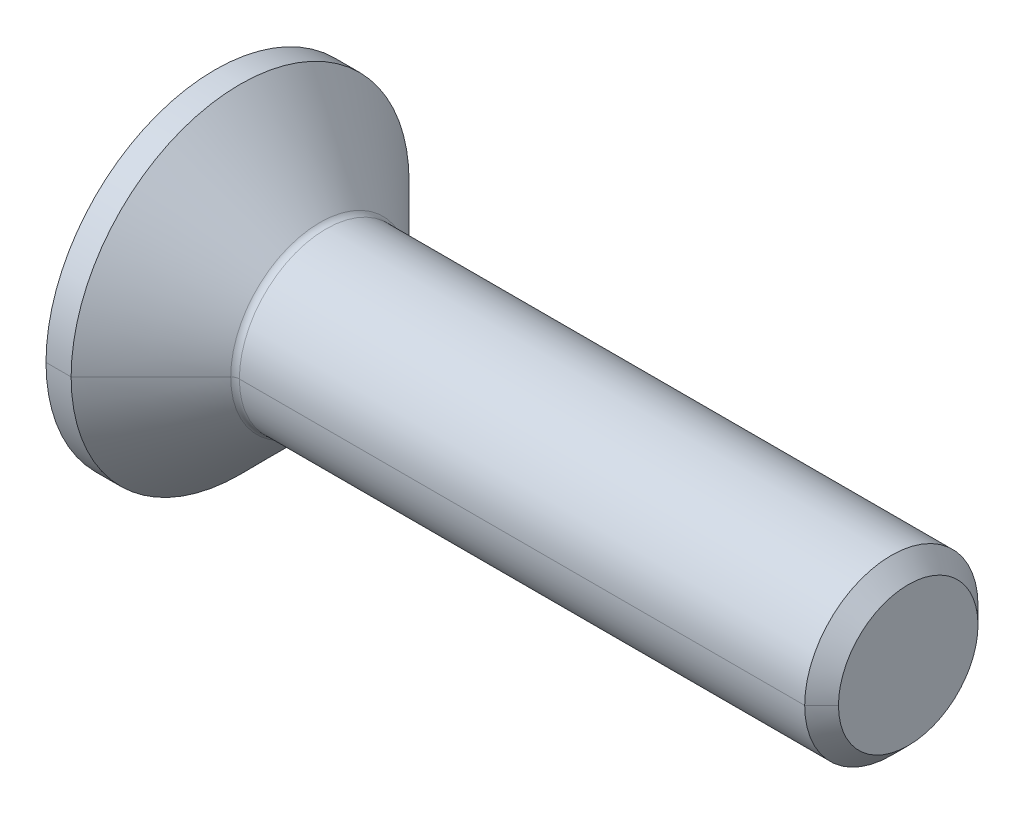
ISO-10303-21;
HEADER;
FILE_DESCRIPTION(('STEP AP214'),'2;1');
FILE_NAME('part.step','',(''),(''),'','','');
FILE_SCHEMA(('AUTOMOTIVE_DESIGN { 1 0 10303 214 1 1 1 1 }'));
ENDSEC;
DATA;
#1=APPLICATION_CONTEXT('core data for automotive mechanical design processes');
#2=APPLICATION_PROTOCOL_DEFINITION('international standard','automotive_design',2000,#1);
#3=PRODUCT_CONTEXT('',#1,'mechanical');
#4=PRODUCT('Part','Part','',(#3));
#5=PRODUCT_RELATED_PRODUCT_CATEGORY('part','',(#4));
#6=PRODUCT_DEFINITION_FORMATION('','',#4);
#7=PRODUCT_DEFINITION_CONTEXT('part definition',#1,'design');
#8=PRODUCT_DEFINITION('design','',#6,#7);
#9=PRODUCT_DEFINITION_SHAPE('','',#8);
#10=(LENGTH_UNIT() NAMED_UNIT(*) SI_UNIT(.MILLI.,.METRE.));
#11=(NAMED_UNIT(*) PLANE_ANGLE_UNIT() SI_UNIT($,.RADIAN.));
#12=(NAMED_UNIT(*) SI_UNIT($,.STERADIAN.) SOLID_ANGLE_UNIT());
#13=UNCERTAINTY_MEASURE_WITH_UNIT(LENGTH_MEASURE(1.E-05),#10,'distance_accuracy_value','');
#14=(GEOMETRIC_REPRESENTATION_CONTEXT(3) GLOBAL_UNCERTAINTY_ASSIGNED_CONTEXT((#13)) GLOBAL_UNIT_ASSIGNED_CONTEXT((#10,
#11,#12)) REPRESENTATION_CONTEXT('',''));
#15=CARTESIAN_POINT('',(0.,0.,0.));
#16=DIRECTION('',(0.,0.,1.));
#17=DIRECTION('',(1.,0.,0.));
#18=AXIS2_PLACEMENT_3D('',#15,#16,#17);
#19=CARTESIAN_POINT('',(1.5,0.,0.));
#20=DIRECTION('',(-1.,0.,0.));
#21=DIRECTION('',(0.,0.,1.));
#22=AXIS2_PLACEMENT_3D('',#19,#20,#21);
#23=CONICAL_SURFACE('',#22,1.25,1.0471975511966);
#24=DIRECTION('',(-0.5,0.,-0.866025403784436));
#25=VECTOR('',#24,1.);
#26=CARTESIAN_POINT('',(1.5,0.,-1.25));
#27=LINE('',#26,#25);
#28=CARTESIAN_POINT('',(2.22168783648704,0.,0.));
#29=VERTEX_POINT('',#28);
#30=CARTESIAN_POINT('',(1.5,0.,-1.25));
#31=VERTEX_POINT('',#30);
#32=EDGE_CURVE('E375',#29,#31,#27,.T.);
#33=ORIENTED_EDGE('',*,*,#32,.F.);
#34=DIRECTION('',(-0.5,0.,0.866025403784436));
#35=VECTOR('',#34,1.);
#36=CARTESIAN_POINT('',(1.5,0.,1.25));
#37=LINE('',#36,#35);
#38=CARTESIAN_POINT('',(1.5,0.,1.25));
#39=VERTEX_POINT('',#38);
#40=EDGE_CURVE('E379',#29,#39,#37,.T.);
#41=ORIENTED_EDGE('',*,*,#40,.T.);
#42=CARTESIAN_POINT('',(1.5,0.,0.));
#43=DIRECTION('',(-1.,0.,0.));
#44=DIRECTION('',(0.,0.,1.));
#45=AXIS2_PLACEMENT_3D('',#42,#43,#44);
#46=CIRCLE('',#45,1.25);
#47=CARTESIAN_POINT('',(1.5,1.08253175473055,0.625));
#48=VERTEX_POINT('',#47);
#49=EDGE_CURVE('E11',#39,#48,#46,.T.);
#50=ORIENTED_EDGE('',*,*,#49,.T.);
#51=CARTESIAN_POINT('',(1.5,0.,0.));
#52=DIRECTION('',(-1.,0.,0.));
#53=DIRECTION('',(0.,0.,1.));
#54=AXIS2_PLACEMENT_3D('',#51,#52,#53);
#55=CIRCLE('',#54,1.25);
#56=CARTESIAN_POINT('',(1.5,1.08253175473055,-0.625));
#57=VERTEX_POINT('',#56);
#58=EDGE_CURVE('E24',#48,#57,#55,.T.);
#59=ORIENTED_EDGE('',*,*,#58,.T.);
#60=CARTESIAN_POINT('',(1.5,0.,0.));
#61=DIRECTION('',(-1.,0.,0.));
#62=DIRECTION('',(0.,0.,1.));
#63=AXIS2_PLACEMENT_3D('',#60,#61,#62);
#64=CIRCLE('',#63,1.25);
#65=EDGE_CURVE('E307',#57,#31,#64,.T.);
#66=ORIENTED_EDGE('',*,*,#65,.T.);
#67=EDGE_LOOP('',(#33,#41,#50,#59,#66));
#68=FACE_BOUND('',#67,.T.);
#69=ADVANCED_FACE('F16',(#68),#23,.F.);
#70=CARTESIAN_POINT('',(1.5,-2.1650635094611,1.25));
#71=DIRECTION('',(-1.,0.,0.));
#72=DIRECTION('',(0.,0.,1.));
#73=AXIS2_PLACEMENT_3D('',#70,#71,#72);
#74=PLANE('',#73);
#75=ORIENTED_EDGE('',*,*,#49,.F.);
#76=DIRECTION('',(0.,-1.,0.));
#77=VECTOR('',#76,1.);
#78=CARTESIAN_POINT('',(1.5,0.721687836487033,1.25));
#79=LINE('',#78,#77);
#80=CARTESIAN_POINT('',(1.5,0.721687836487033,1.25));
#81=VERTEX_POINT('',#80);
#82=EDGE_CURVE('E48',#81,#39,#79,.T.);
#83=ORIENTED_EDGE('',*,*,#82,.F.);
#84=DIRECTION('',(0.,-0.5,0.866025403784439));
#85=VECTOR('',#84,1.);
#86=CARTESIAN_POINT('',(1.5,1.44337567297407,0.));
#87=LINE('',#86,#85);
#88=EDGE_CURVE('E334',#48,#81,#87,.T.);
#89=ORIENTED_EDGE('',*,*,#88,.F.);
#90=EDGE_LOOP('',(#75,#83,#89));
#91=FACE_BOUND('',#90,.T.);
#92=ADVANCED_FACE('F434',(#91),#74,.T.);
#93=CARTESIAN_POINT('',(1.5,-2.1650635094611,1.25));
#94=DIRECTION('',(-1.,0.,0.));
#95=DIRECTION('',(0.,0.,1.));
#96=AXIS2_PLACEMENT_3D('',#93,#94,#95);
#97=PLANE('',#96);
#98=ORIENTED_EDGE('',*,*,#58,.F.);
#99=DIRECTION('',(0.,-0.5,0.866025403784439));
#100=VECTOR('',#99,1.);
#101=CARTESIAN_POINT('',(1.5,1.44337567297407,0.));
#102=LINE('',#101,#100);
#103=CARTESIAN_POINT('',(1.5,1.44337567297407,0.));
#104=VERTEX_POINT('',#103);
#105=EDGE_CURVE('E330',#104,#48,#102,.T.);
#106=ORIENTED_EDGE('',*,*,#105,.F.);
#107=DIRECTION('',(0.,0.5,0.866025403784439));
#108=VECTOR('',#107,1.);
#109=CARTESIAN_POINT('',(1.5,0.721687836487033,-1.25));
#110=LINE('',#109,#108);
#111=EDGE_CURVE('E323',#57,#104,#110,.T.);
#112=ORIENTED_EDGE('',*,*,#111,.F.);
#113=EDGE_LOOP('',(#98,#106,#112));
#114=FACE_BOUND('',#113,.T.);
#115=ADVANCED_FACE('F357',(#114),#97,.T.);
#116=CARTESIAN_POINT('',(1.5,-2.1650635094611,1.25));
#117=DIRECTION('',(-1.,0.,0.));
#118=DIRECTION('',(0.,0.,1.));
#119=AXIS2_PLACEMENT_3D('',#116,#117,#118);
#120=PLANE('',#119);
#121=ORIENTED_EDGE('',*,*,#65,.F.);
#122=DIRECTION('',(0.,0.5,0.866025403784439));
#123=VECTOR('',#122,1.);
#124=CARTESIAN_POINT('',(1.5,0.721687836487033,-1.25));
#125=LINE('',#124,#123);
#126=CARTESIAN_POINT('',(1.5,0.721687836487033,-1.25));
#127=VERTEX_POINT('',#126);
#128=EDGE_CURVE('E285',#127,#57,#125,.T.);
#129=ORIENTED_EDGE('',*,*,#128,.F.);
#130=DIRECTION('',(0.,1.,0.));
#131=VECTOR('',#130,1.);
#132=CARTESIAN_POINT('',(1.5,-0.721687836487031,-1.25));
#133=LINE('',#132,#131);
#134=EDGE_CURVE('E286',#31,#127,#133,.T.);
#135=ORIENTED_EDGE('',*,*,#134,.F.);
#136=EDGE_LOOP('',(#121,#129,#135));
#137=FACE_BOUND('',#136,.T.);
#138=ADVANCED_FACE('F355',(#137),#120,.T.);
#139=CARTESIAN_POINT('',(1.5,-2.1650635094611,1.25));
#140=DIRECTION('',(-1.,0.,0.));
#141=DIRECTION('',(0.,0.,1.));
#142=AXIS2_PLACEMENT_3D('',#139,#140,#141);
#143=PLANE('',#142);
#144=CARTESIAN_POINT('',(1.5,0.,0.));
#145=DIRECTION('',(-1.,0.,0.));
#146=DIRECTION('',(0.,0.,1.));
#147=AXIS2_PLACEMENT_3D('',#144,#145,#146);
#148=CIRCLE('',#147,1.25);
#149=CARTESIAN_POINT('',(1.5,-1.08253175473055,-0.625));
#150=VERTEX_POINT('',#149);
#151=EDGE_CURVE('E369',#31,#150,#148,.T.);
#152=ORIENTED_EDGE('',*,*,#151,.F.);
#153=DIRECTION('',(0.,1.,0.));
#154=VECTOR('',#153,1.);
#155=CARTESIAN_POINT('',(1.5,-0.721687836487031,-1.25));
#156=LINE('',#155,#154);
#157=CARTESIAN_POINT('',(1.5,-0.721687836487031,-1.25));
#158=VERTEX_POINT('',#157);
#159=EDGE_CURVE('E313',#158,#31,#156,.T.);
#160=ORIENTED_EDGE('',*,*,#159,.F.);
#161=DIRECTION('',(0.,0.5,-0.866025403784439));
#162=VECTOR('',#161,1.);
#163=CARTESIAN_POINT('',(1.5,-1.44337567297406,0.));
#164=LINE('',#163,#162);
#165=EDGE_CURVE('E302',#150,#158,#164,.T.);
#166=ORIENTED_EDGE('',*,*,#165,.F.);
#167=EDGE_LOOP('',(#152,#160,#166));
#168=FACE_BOUND('',#167,.T.);
#169=ADVANCED_FACE('F371',(#168),#143,.T.);
#170=CARTESIAN_POINT('',(1.5,-2.1650635094611,1.25));
#171=DIRECTION('',(-1.,0.,0.));
#172=DIRECTION('',(0.,0.,1.));
#173=AXIS2_PLACEMENT_3D('',#170,#171,#172);
#174=PLANE('',#173);
#175=CARTESIAN_POINT('',(1.5,0.,0.));
#176=DIRECTION('',(-1.,0.,0.));
#177=DIRECTION('',(0.,0.,1.));
#178=AXIS2_PLACEMENT_3D('',#175,#176,#177);
#179=CIRCLE('',#178,1.25);
#180=CARTESIAN_POINT('',(1.5,-1.08253175473055,0.625));
#181=VERTEX_POINT('',#180);
#182=EDGE_CURVE('E213',#150,#181,#179,.T.);
#183=ORIENTED_EDGE('',*,*,#182,.F.);
#184=DIRECTION('',(0.,0.5,-0.866025403784439));
#185=VECTOR('',#184,1.);
#186=CARTESIAN_POINT('',(1.5,-1.44337567297406,0.));
#187=LINE('',#186,#185);
#188=CARTESIAN_POINT('',(1.5,-1.44337567297406,0.));
#189=VERTEX_POINT('',#188);
#190=EDGE_CURVE('E298',#189,#150,#187,.T.);
#191=ORIENTED_EDGE('',*,*,#190,.F.);
#192=DIRECTION('',(0.,-0.5,-0.866025403784439));
#193=VECTOR('',#192,1.);
#194=CARTESIAN_POINT('',(1.5,-0.721687836487031,1.25));
#195=LINE('',#194,#193);
#196=EDGE_CURVE('E310',#181,#189,#195,.T.);
#197=ORIENTED_EDGE('',*,*,#196,.F.);
#198=EDGE_LOOP('',(#183,#191,#197));
#199=FACE_BOUND('',#198,.T.);
#200=ADVANCED_FACE('F449',(#199),#174,.T.);
#201=CARTESIAN_POINT('',(1.5,-2.1650635094611,1.25));
#202=DIRECTION('',(-1.,0.,0.));
#203=DIRECTION('',(0.,0.,1.));
#204=AXIS2_PLACEMENT_3D('',#201,#202,#203);
#205=PLANE('',#204);
#206=CARTESIAN_POINT('',(1.5,0.,0.));
#207=DIRECTION('',(-1.,0.,0.));
#208=DIRECTION('',(0.,0.,1.));
#209=AXIS2_PLACEMENT_3D('',#206,#207,#208);
#210=CIRCLE('',#209,1.25);
#211=EDGE_CURVE('E206',#181,#39,#210,.T.);
#212=ORIENTED_EDGE('',*,*,#211,.F.);
#213=DIRECTION('',(0.,-0.5,-0.866025403784439));
#214=VECTOR('',#213,1.);
#215=CARTESIAN_POINT('',(1.5,-0.721687836487031,1.25));
#216=LINE('',#215,#214);
#217=CARTESIAN_POINT('',(1.5,-0.721687836487031,1.25));
#218=VERTEX_POINT('',#217);
#219=EDGE_CURVE('E37',#218,#181,#216,.T.);
#220=ORIENTED_EDGE('',*,*,#219,.F.);
#221=DIRECTION('',(0.,-1.,0.));
#222=VECTOR('',#221,1.);
#223=CARTESIAN_POINT('',(1.5,0.721687836487033,1.25));
#224=LINE('',#223,#222);
#225=EDGE_CURVE('E244',#39,#218,#224,.T.);
#226=ORIENTED_EDGE('',*,*,#225,.F.);
#227=EDGE_LOOP('',(#212,#220,#226));
#228=FACE_BOUND('',#227,.T.);
#229=ADVANCED_FACE('F452',(#228),#205,.T.);
#230=CARTESIAN_POINT('',(1.5,-0.721687836487031,1.25));
#231=DIRECTION('',(0.,0.866025403784439,-0.5));
#232=DIRECTION('',(-1.,0.,0.));
#233=AXIS2_PLACEMENT_3D('',#230,#231,#232);
#234=PLANE('',#233);
#235=DIRECTION('',(0.,-0.5,-0.866025403784439));
#236=VECTOR('',#235,1.);
#237=CARTESIAN_POINT('',(0.,-0.721687836487031,1.25));
#238=LINE('',#237,#236);
#239=CARTESIAN_POINT('',(0.,-0.721687836487031,1.25));
#240=VERTEX_POINT('',#239);
#241=CARTESIAN_POINT('',(0.,-1.44337567297406,0.));
#242=VERTEX_POINT('',#241);
#243=EDGE_CURVE('E230',#240,#242,#238,.T.);
#244=ORIENTED_EDGE('',*,*,#243,.F.);
#245=DIRECTION('',(-1.,0.,0.));
#246=VECTOR('',#245,1.);
#247=CARTESIAN_POINT('',(1.5,-0.721687836487031,1.25));
#248=LINE('',#247,#246);
#249=EDGE_CURVE('E241',#218,#240,#248,.T.);
#250=ORIENTED_EDGE('',*,*,#249,.F.);
#251=ORIENTED_EDGE('',*,*,#219,.T.);
#252=ORIENTED_EDGE('',*,*,#196,.T.);
#253=DIRECTION('',(-1.,0.,0.));
#254=VECTOR('',#253,1.);
#255=CARTESIAN_POINT('',(1.5,-1.44337567297406,0.));
#256=LINE('',#255,#254);
#257=EDGE_CURVE('E295',#189,#242,#256,.T.);
#258=ORIENTED_EDGE('',*,*,#257,.T.);
#259=EDGE_LOOP('',(#244,#250,#251,#252,#258));
#260=FACE_BOUND('',#259,.T.);
#261=ADVANCED_FACE('F456',(#260),#234,.T.);
#262=CARTESIAN_POINT('',(1.5,0.721687836487033,1.25));
#263=DIRECTION('',(0.,0.,-1.));
#264=DIRECTION('',(0.,-1.,0.));
#265=AXIS2_PLACEMENT_3D('',#262,#263,#264);
#266=PLANE('',#265);
#267=DIRECTION('',(0.,-1.,0.));
#268=VECTOR('',#267,1.);
#269=CARTESIAN_POINT('',(0.,0.721687836487033,1.25));
#270=LINE('',#269,#268);
#271=CARTESIAN_POINT('',(0.,0.721687836487033,1.25));
#272=VERTEX_POINT('',#271);
#273=EDGE_CURVE('E221',#272,#240,#270,.T.);
#274=ORIENTED_EDGE('',*,*,#273,.F.);
#275=DIRECTION('',(-1.,0.,0.));
#276=VECTOR('',#275,1.);
#277=CARTESIAN_POINT('',(1.5,0.721687836487033,1.25));
#278=LINE('',#277,#276);
#279=EDGE_CURVE('E338',#81,#272,#278,.T.);
#280=ORIENTED_EDGE('',*,*,#279,.F.);
#281=ORIENTED_EDGE('',*,*,#82,.T.);
#282=ORIENTED_EDGE('',*,*,#225,.T.);
#283=ORIENTED_EDGE('',*,*,#249,.T.);
#284=EDGE_LOOP('',(#274,#280,#281,#282,#283));
#285=FACE_BOUND('',#284,.T.);
#286=ADVANCED_FACE('F459',(#285),#266,.T.);
#287=CARTESIAN_POINT('',(1.5,1.44337567297407,0.));
#288=DIRECTION('',(0.,-0.866025403784439,-0.5));
#289=DIRECTION('',(0.,0.5,-0.866025403784439));
#290=AXIS2_PLACEMENT_3D('',#287,#288,#289);
#291=PLANE('',#290);
#292=DIRECTION('',(0.,-0.5,0.866025403784439));
#293=VECTOR('',#292,1.);
#294=CARTESIAN_POINT('',(0.,1.44337567297407,0.));
#295=LINE('',#294,#293);
#296=CARTESIAN_POINT('',(0.,1.44337567297407,0.));
#297=VERTEX_POINT('',#296);
#298=EDGE_CURVE('E217',#297,#272,#295,.T.);
#299=ORIENTED_EDGE('',*,*,#298,.F.);
#300=DIRECTION('',(-1.,0.,0.));
#301=VECTOR('',#300,1.);
#302=CARTESIAN_POINT('',(1.5,1.44337567297407,0.));
#303=LINE('',#302,#301);
#304=EDGE_CURVE('E327',#104,#297,#303,.T.);
#305=ORIENTED_EDGE('',*,*,#304,.F.);
#306=ORIENTED_EDGE('',*,*,#105,.T.);
#307=ORIENTED_EDGE('',*,*,#88,.T.);
#308=ORIENTED_EDGE('',*,*,#279,.T.);
#309=EDGE_LOOP('',(#299,#305,#306,#307,#308));
#310=FACE_BOUND('',#309,.T.);
#311=ADVANCED_FACE('F463',(#310),#291,.T.);
#312=CARTESIAN_POINT('',(1.5,0.721687836487033,-1.25));
#313=DIRECTION('',(0.,-0.866025403784439,0.5));
#314=DIRECTION('',(-1.,0.,0.));
#315=AXIS2_PLACEMENT_3D('',#312,#313,#314);
#316=PLANE('',#315);
#317=DIRECTION('',(0.,0.5,0.866025403784439));
#318=VECTOR('',#317,1.);
#319=CARTESIAN_POINT('',(0.,0.721687836487033,-1.25));
#320=LINE('',#319,#318);
#321=CARTESIAN_POINT('',(0.,0.721687836487033,-1.25));
#322=VERTEX_POINT('',#321);
#323=EDGE_CURVE('E222',#322,#297,#320,.T.);
#324=ORIENTED_EDGE('',*,*,#323,.F.);
#325=DIRECTION('',(-1.,0.,0.));
#326=VECTOR('',#325,1.);
#327=CARTESIAN_POINT('',(1.5,0.721687836487033,-1.25));
#328=LINE('',#327,#326);
#329=EDGE_CURVE('E282',#127,#322,#328,.T.);
#330=ORIENTED_EDGE('',*,*,#329,.F.);
#331=ORIENTED_EDGE('',*,*,#128,.T.);
#332=ORIENTED_EDGE('',*,*,#111,.T.);
#333=ORIENTED_EDGE('',*,*,#304,.T.);
#334=EDGE_LOOP('',(#324,#330,#331,#332,#333));
#335=FACE_BOUND('',#334,.T.);
#336=ADVANCED_FACE('F361',(#335),#316,.T.);
#337=CARTESIAN_POINT('',(1.5,-0.721687836487031,-1.25));
#338=DIRECTION('',(0.,0.,1.));
#339=DIRECTION('',(0.,-1.,0.));
#340=AXIS2_PLACEMENT_3D('',#337,#338,#339);
#341=PLANE('',#340);
#342=DIRECTION('',(0.,1.,0.));
#343=VECTOR('',#342,1.);
#344=CARTESIAN_POINT('',(0.,-0.721687836487031,-1.25));
#345=LINE('',#344,#343);
#346=CARTESIAN_POINT('',(0.,-0.721687836487031,-1.25));
#347=VERTEX_POINT('',#346);
#348=EDGE_CURVE('E272',#347,#322,#345,.T.);
#349=ORIENTED_EDGE('',*,*,#348,.F.);
#350=DIRECTION('',(-1.,0.,0.));
#351=VECTOR('',#350,1.);
#352=CARTESIAN_POINT('',(1.5,-0.721687836487031,-1.25));
#353=LINE('',#352,#351);
#354=EDGE_CURVE('E306',#158,#347,#353,.T.);
#355=ORIENTED_EDGE('',*,*,#354,.F.);
#356=ORIENTED_EDGE('',*,*,#159,.T.);
#357=ORIENTED_EDGE('',*,*,#134,.T.);
#358=ORIENTED_EDGE('',*,*,#329,.T.);
#359=EDGE_LOOP('',(#349,#355,#356,#357,#358));
#360=FACE_BOUND('',#359,.T.);
#361=ADVANCED_FACE('F364',(#360),#341,.T.);
#362=CARTESIAN_POINT('',(1.5,-1.44337567297406,0.));
#363=DIRECTION('',(0.,0.866025403784439,0.5));
#364=DIRECTION('',(1.,0.,0.));
#365=AXIS2_PLACEMENT_3D('',#362,#363,#364);
#366=PLANE('',#365);
#367=DIRECTION('',(0.,0.5,-0.866025403784439));
#368=VECTOR('',#367,1.);
#369=CARTESIAN_POINT('',(0.,-1.44337567297406,0.));
#370=LINE('',#369,#368);
#371=EDGE_CURVE('E268',#242,#347,#370,.T.);
#372=ORIENTED_EDGE('',*,*,#371,.F.);
#373=ORIENTED_EDGE('',*,*,#257,.F.);
#374=ORIENTED_EDGE('',*,*,#190,.T.);
#375=ORIENTED_EDGE('',*,*,#165,.T.);
#376=ORIENTED_EDGE('',*,*,#354,.T.);
#377=EDGE_LOOP('',(#372,#373,#374,#375,#376));
#378=FACE_BOUND('',#377,.T.);
#379=ADVANCED_FACE('F472',(#378),#366,.T.);
#380=CARTESIAN_POINT('',(2.56284271247466,0.,0.));
#381=DIRECTION('',(-1.,0.,0.));
#382=DIRECTION('',(0.,0.,1.));
#383=AXIS2_PLACEMENT_3D('',#380,#381,#382);
#384=TOROIDAL_SURFACE('',#383,2.19999999999995,0.2);
#385=CARTESIAN_POINT('',(2.56284271247466,0.,-2.19999999999995));
#386=DIRECTION('',(0.,1.,0.));
#387=DIRECTION('',(0.,0.,1.));
#388=AXIS2_PLACEMENT_3D('',#385,#386,#387);
#389=CIRCLE('',#388,0.2);
#390=CARTESIAN_POINT('',(2.42142135623735,0.,-2.05857864376265));
#391=VERTEX_POINT('',#390);
#392=CARTESIAN_POINT('',(2.56284271247466,0.,-1.99999999999995));
#393=VERTEX_POINT('',#392);
#394=EDGE_CURVE('E193',#391,#393,#389,.T.);
#395=ORIENTED_EDGE('',*,*,#394,.F.);
#396=CARTESIAN_POINT('',(2.42142135623735,0.,0.));
#397=DIRECTION('',(-1.,0.,0.));
#398=DIRECTION('',(0.,0.,1.));
#399=AXIS2_PLACEMENT_3D('',#396,#397,#398);
#400=CIRCLE('',#399,2.05857864376265);
#401=CARTESIAN_POINT('',(2.42142135623735,0.,2.05857864376265));
#402=VERTEX_POINT('',#401);
#403=EDGE_CURVE('E180',#402,#391,#400,.T.);
#404=ORIENTED_EDGE('',*,*,#403,.F.);
#405=CARTESIAN_POINT('',(2.56284271247466,0.,2.19999999999995));
#406=DIRECTION('',(0.,-1.,0.));
#407=DIRECTION('',(0.,0.,-1.));
#408=AXIS2_PLACEMENT_3D('',#405,#406,#407);
#409=CIRCLE('',#408,0.2);
#410=CARTESIAN_POINT('',(2.56284271247466,0.,1.99999999999995));
#411=VERTEX_POINT('',#410);
#412=EDGE_CURVE('E204',#402,#411,#409,.T.);
#413=ORIENTED_EDGE('',*,*,#412,.T.);
#414=CARTESIAN_POINT('',(2.56284271247466,0.,0.));
#415=DIRECTION('',(1.,0.,0.));
#416=DIRECTION('',(0.,0.,1.));
#417=AXIS2_PLACEMENT_3D('',#414,#415,#416);
#418=CIRCLE('',#417,1.99999999999995);
#419=EDGE_CURVE('E196',#393,#411,#418,.T.);
#420=ORIENTED_EDGE('',*,*,#419,.F.);
#421=EDGE_LOOP('',(#395,#404,#413,#420));
#422=FACE_BOUND('',#421,.T.);
#423=ADVANCED_FACE('F194',(#422),#384,.F.);
#424=CARTESIAN_POINT('',(16.,1.61,0.));
#425=DIRECTION('',(1.,0.,0.));
#426=DIRECTION('',(0.,1.,0.));
#427=AXIS2_PLACEMENT_3D('',#424,#425,#426);
#428=PLANE('',#427);
#429=CARTESIAN_POINT('',(16.,0.,0.));
#430=DIRECTION('',(-1.,0.,0.));
#431=DIRECTION('',(0.,0.,1.));
#432=AXIS2_PLACEMENT_3D('',#429,#430,#431);
#433=CIRCLE('',#432,1.61);
#434=CARTESIAN_POINT('',(16.,0.,1.61));
#435=VERTEX_POINT('',#434);
#436=CARTESIAN_POINT('',(16.,0.,-1.61));
#437=VERTEX_POINT('',#436);
#438=EDGE_CURVE('E240',#435,#437,#433,.T.);
#439=ORIENTED_EDGE('',*,*,#438,.F.);
#440=CARTESIAN_POINT('',(16.,0.,0.));
#441=DIRECTION('',(-1.,0.,0.));
#442=DIRECTION('',(0.,0.,1.));
#443=AXIS2_PLACEMENT_3D('',#440,#441,#442);
#444=CIRCLE('',#443,1.61);
#445=EDGE_CURVE('E292',#437,#435,#444,.T.);
#446=ORIENTED_EDGE('',*,*,#445,.F.);
#447=EDGE_LOOP('',(#439,#446));
#448=FACE_BOUND('',#447,.T.);
#449=ADVANCED_FACE('F412',(#448),#428,.T.);
#450=CARTESIAN_POINT('',(16.,0.,0.));
#451=DIRECTION('',(-1.,0.,0.));
#452=DIRECTION('',(0.,0.,1.));
#453=AXIS2_PLACEMENT_3D('',#450,#451,#452);
#454=CONICAL_SURFACE('',#453,1.61,0.785398163397243);
#455=DIRECTION('',(-0.707106781186693,0.,-0.707106781186402));
#456=VECTOR('',#455,1.);
#457=CARTESIAN_POINT('',(16.,0.,-1.61));
#458=LINE('',#457,#456);
#459=CARTESIAN_POINT('',(15.61,0.,-1.99999999999991));
#460=VERTEX_POINT('',#459);
#461=EDGE_CURVE('E235',#437,#460,#458,.T.);
#462=ORIENTED_EDGE('',*,*,#461,.F.);
#463=ORIENTED_EDGE('',*,*,#445,.T.);
#464=DIRECTION('',(-0.707106781186693,0.,0.707106781186402));
#465=VECTOR('',#464,1.);
#466=CARTESIAN_POINT('',(16.,0.,1.61));
#467=LINE('',#466,#465);
#468=CARTESIAN_POINT('',(15.61,0.,1.99999999999991));
#469=VERTEX_POINT('',#468);
#470=EDGE_CURVE('E226',#435,#469,#467,.T.);
#471=ORIENTED_EDGE('',*,*,#470,.T.);
#472=CARTESIAN_POINT('',(15.61,0.,0.));
#473=DIRECTION('',(-1.,0.,0.));
#474=DIRECTION('',(0.,0.,1.));
#475=AXIS2_PLACEMENT_3D('',#472,#473,#474);
#476=CIRCLE('',#475,1.99999999999991);
#477=EDGE_CURVE('E289',#460,#469,#476,.T.);
#478=ORIENTED_EDGE('',*,*,#477,.F.);
#479=EDGE_LOOP('',(#462,#463,#471,#478));
#480=FACE_BOUND('',#479,.T.);
#481=ADVANCED_FACE('F414',(#480),#454,.T.);
#482=CARTESIAN_POINT('',(0.,0.,0.));
#483=DIRECTION('',(-1.,0.,0.));
#484=DIRECTION('',(0.,0.,1.));
#485=AXIS2_PLACEMENT_3D('',#482,#483,#484);
#486=CYLINDRICAL_SURFACE('',#485,1.99999999999995);
#487=DIRECTION('',(-1.,0.,0.));
#488=VECTOR('',#487,1.);
#489=CARTESIAN_POINT('',(0.,0.,-1.99999999999995));
#490=LINE('',#489,#488);
#491=EDGE_CURVE('E223',#460,#393,#490,.T.);
#492=ORIENTED_EDGE('',*,*,#491,.F.);
#493=ORIENTED_EDGE('',*,*,#477,.T.);
#494=DIRECTION('',(-1.,0.,0.));
#495=VECTOR('',#494,1.);
#496=CARTESIAN_POINT('',(0.,0.,1.99999999999995));
#497=LINE('',#496,#495);
#498=EDGE_CURVE('E190',#469,#411,#497,.T.);
#499=ORIENTED_EDGE('',*,*,#498,.T.);
#500=CARTESIAN_POINT('',(2.56284271247466,0.,0.));
#501=DIRECTION('',(1.,0.,0.));
#502=DIRECTION('',(0.,0.,1.));
#503=AXIS2_PLACEMENT_3D('',#500,#501,#502);
#504=CIRCLE('',#503,1.99999999999995);
#505=EDGE_CURVE('E201',#411,#393,#504,.T.);
#506=ORIENTED_EDGE('',*,*,#505,.T.);
#507=EDGE_LOOP('',(#492,#493,#499,#506));
#508=FACE_BOUND('',#507,.T.);
#509=ADVANCED_FACE('F418',(#508),#486,.T.);
#510=CARTESIAN_POINT('',(0.580000000000009,0.,0.));
#511=DIRECTION('',(-1.,0.,0.));
#512=DIRECTION('',(0.,0.,1.));
#513=AXIS2_PLACEMENT_3D('',#510,#511,#512);
#514=CONICAL_SURFACE('',#513,3.9,0.78539816339745);
#515=DIRECTION('',(-0.707106781186546,0.,-0.707106781186549));
#516=VECTOR('',#515,1.);
#517=CARTESIAN_POINT('',(0.580000000000009,0.,-3.9));
#518=LINE('',#517,#516);
#519=CARTESIAN_POINT('',(0.580000000000009,0.,-3.9));
#520=VERTEX_POINT('',#519);
#521=EDGE_CURVE('E168',#391,#520,#518,.T.);
#522=ORIENTED_EDGE('',*,*,#521,.F.);
#523=CARTESIAN_POINT('',(2.42142135623735,0.,0.));
#524=DIRECTION('',(-1.,0.,0.));
#525=DIRECTION('',(0.,0.,1.));
#526=AXIS2_PLACEMENT_3D('',#523,#524,#525);
#527=CIRCLE('',#526,2.05857864376265);
#528=EDGE_CURVE('E173',#391,#402,#527,.T.);
#529=ORIENTED_EDGE('',*,*,#528,.T.);
#530=DIRECTION('',(-0.707106781186546,0.,0.707106781186549));
#531=VECTOR('',#530,1.);
#532=CARTESIAN_POINT('',(0.580000000000009,0.,3.9));
#533=LINE('',#532,#531);
#534=CARTESIAN_POINT('',(0.580000000000009,0.,3.9));
#535=VERTEX_POINT('',#534);
#536=EDGE_CURVE('E185',#402,#535,#533,.T.);
#537=ORIENTED_EDGE('',*,*,#536,.T.);
#538=CARTESIAN_POINT('',(0.580000000000009,0.,0.));
#539=DIRECTION('',(-1.,0.,0.));
#540=DIRECTION('',(0.,0.,1.));
#541=AXIS2_PLACEMENT_3D('',#538,#539,#540);
#542=CIRCLE('',#541,3.9);
#543=EDGE_CURVE('E174',#520,#535,#542,.T.);
#544=ORIENTED_EDGE('',*,*,#543,.F.);
#545=EDGE_LOOP('',(#522,#529,#537,#544));
#546=FACE_BOUND('',#545,.T.);
#547=ADVANCED_FACE('F170',(#546),#514,.T.);
#548=CARTESIAN_POINT('',(0.,0.,0.));
#549=DIRECTION('',(-1.,0.,0.));
#550=DIRECTION('',(0.,0.,1.));
#551=AXIS2_PLACEMENT_3D('',#548,#549,#550);
#552=CYLINDRICAL_SURFACE('',#551,3.9);
#553=DIRECTION('',(-1.,0.,0.));
#554=VECTOR('',#553,1.);
#555=CARTESIAN_POINT('',(0.,0.,-3.9));
#556=LINE('',#555,#554);
#557=CARTESIAN_POINT('',(0.,0.,-3.9));
#558=VERTEX_POINT('',#557);
#559=EDGE_CURVE('E254',#520,#558,#556,.T.);
#560=ORIENTED_EDGE('',*,*,#559,.F.);
#561=ORIENTED_EDGE('',*,*,#543,.T.);
#562=DIRECTION('',(-1.,0.,0.));
#563=VECTOR('',#562,1.);
#564=CARTESIAN_POINT('',(0.,0.,3.9));
#565=LINE('',#564,#563);
#566=CARTESIAN_POINT('',(0.,0.,3.9));
#567=VERTEX_POINT('',#566);
#568=EDGE_CURVE('E231',#535,#567,#565,.T.);
#569=ORIENTED_EDGE('',*,*,#568,.T.);
#570=CARTESIAN_POINT('',(0.,0.,0.));
#571=DIRECTION('',(-1.,0.,0.));
#572=DIRECTION('',(0.,0.,1.));
#573=AXIS2_PLACEMENT_3D('',#570,#571,#572);
#574=CIRCLE('',#573,3.9);
#575=EDGE_CURVE('E227',#558,#567,#574,.T.);
#576=ORIENTED_EDGE('',*,*,#575,.F.);
#577=EDGE_LOOP('',(#560,#561,#569,#576));
#578=FACE_BOUND('',#577,.T.);
#579=ADVANCED_FACE('F478',(#578),#552,.T.);
#580=CARTESIAN_POINT('',(0.,0.,0.));
#581=DIRECTION('',(-1.,0.,0.));
#582=DIRECTION('',(0.,0.,1.));
#583=AXIS2_PLACEMENT_3D('',#580,#581,#582);
#584=PLANE('',#583);
#585=ORIENTED_EDGE('',*,*,#243,.T.);
#586=ORIENTED_EDGE('',*,*,#371,.T.);
#587=ORIENTED_EDGE('',*,*,#348,.T.);
#588=ORIENTED_EDGE('',*,*,#323,.T.);
#589=ORIENTED_EDGE('',*,*,#298,.T.);
#590=ORIENTED_EDGE('',*,*,#273,.T.);
#591=EDGE_LOOP('',(#585,#586,#587,#588,#589,#590));
#592=FACE_BOUND('',#591,.T.);
#593=CARTESIAN_POINT('',(0.,0.,0.));
#594=DIRECTION('',(-1.,0.,0.));
#595=DIRECTION('',(0.,0.,1.));
#596=AXIS2_PLACEMENT_3D('',#593,#594,#595);
#597=CIRCLE('',#596,3.9);
#598=EDGE_CURVE('E258',#567,#558,#597,.T.);
#599=ORIENTED_EDGE('',*,*,#598,.T.);
#600=ORIENTED_EDGE('',*,*,#575,.T.);
#601=EDGE_LOOP('',(#599,#600));
#602=FACE_BOUND('',#601,.T.);
#603=ADVANCED_FACE('F475',(#592,#602),#584,.T.);
#604=CARTESIAN_POINT('',(0.,0.,0.));
#605=DIRECTION('',(-1.,0.,0.));
#606=DIRECTION('',(0.,0.,1.));
#607=AXIS2_PLACEMENT_3D('',#604,#605,#606);
#608=CYLINDRICAL_SURFACE('',#607,3.9);
#609=CARTESIAN_POINT('',(0.580000000000009,0.,0.));
#610=DIRECTION('',(-1.,0.,0.));
#611=DIRECTION('',(0.,0.,1.));
#612=AXIS2_PLACEMENT_3D('',#609,#610,#611);
#613=CIRCLE('',#612,3.9);
#614=EDGE_CURVE('E179',#535,#520,#613,.T.);
#615=ORIENTED_EDGE('',*,*,#614,.T.);
#616=ORIENTED_EDGE('',*,*,#559,.T.);
#617=ORIENTED_EDGE('',*,*,#598,.F.);
#618=ORIENTED_EDGE('',*,*,#568,.F.);
#619=EDGE_LOOP('',(#615,#616,#617,#618));
#620=FACE_BOUND('',#619,.T.);
#621=ADVANCED_FACE('F430',(#620),#608,.T.);
#622=CARTESIAN_POINT('',(0.580000000000009,0.,0.));
#623=DIRECTION('',(-1.,0.,0.));
#624=DIRECTION('',(0.,0.,1.));
#625=AXIS2_PLACEMENT_3D('',#622,#623,#624);
#626=CONICAL_SURFACE('',#625,3.9,0.78539816339745);
#627=ORIENTED_EDGE('',*,*,#403,.T.);
#628=ORIENTED_EDGE('',*,*,#521,.T.);
#629=ORIENTED_EDGE('',*,*,#614,.F.);
#630=ORIENTED_EDGE('',*,*,#536,.F.);
#631=EDGE_LOOP('',(#627,#628,#629,#630));
#632=FACE_BOUND('',#631,.T.);
#633=ADVANCED_FACE('F184',(#632),#626,.T.);
#634=CARTESIAN_POINT('',(0.,0.,0.));
#635=DIRECTION('',(-1.,0.,0.));
#636=DIRECTION('',(0.,0.,1.));
#637=AXIS2_PLACEMENT_3D('',#634,#635,#636);
#638=CYLINDRICAL_SURFACE('',#637,1.99999999999995);
#639=CARTESIAN_POINT('',(15.61,0.,0.));
#640=DIRECTION('',(-1.,0.,0.));
#641=DIRECTION('',(0.,0.,1.));
#642=AXIS2_PLACEMENT_3D('',#639,#640,#641);
#643=CIRCLE('',#642,1.99999999999991);
#644=EDGE_CURVE('E239',#469,#460,#643,.T.);
#645=ORIENTED_EDGE('',*,*,#644,.T.);
#646=ORIENTED_EDGE('',*,*,#491,.T.);
#647=ORIENTED_EDGE('',*,*,#419,.T.);
#648=ORIENTED_EDGE('',*,*,#498,.F.);
#649=EDGE_LOOP('',(#645,#646,#647,#648));
#650=FACE_BOUND('',#649,.T.);
#651=ADVANCED_FACE('F420',(#650),#638,.T.);
#652=CARTESIAN_POINT('',(16.,0.,0.));
#653=DIRECTION('',(-1.,0.,0.));
#654=DIRECTION('',(0.,0.,1.));
#655=AXIS2_PLACEMENT_3D('',#652,#653,#654);
#656=CONICAL_SURFACE('',#655,1.61,0.785398163397243);
#657=ORIENTED_EDGE('',*,*,#438,.T.);
#658=ORIENTED_EDGE('',*,*,#461,.T.);
#659=ORIENTED_EDGE('',*,*,#644,.F.);
#660=ORIENTED_EDGE('',*,*,#470,.F.);
#661=EDGE_LOOP('',(#657,#658,#659,#660));
#662=FACE_BOUND('',#661,.T.);
#663=ADVANCED_FACE('F408',(#662),#656,.T.);
#664=CARTESIAN_POINT('',(2.56284271247466,0.,0.));
#665=DIRECTION('',(-1.,0.,0.));
#666=DIRECTION('',(0.,0.,1.));
#667=AXIS2_PLACEMENT_3D('',#664,#665,#666);
#668=TOROIDAL_SURFACE('',#667,2.19999999999995,0.2);
#669=ORIENTED_EDGE('',*,*,#528,.F.);
#670=ORIENTED_EDGE('',*,*,#394,.T.);
#671=ORIENTED_EDGE('',*,*,#505,.F.);
#672=ORIENTED_EDGE('',*,*,#412,.F.);
#673=EDGE_LOOP('',(#669,#670,#671,#672));
#674=FACE_BOUND('',#673,.T.);
#675=ADVANCED_FACE('F203',(#674),#668,.F.);
#676=CARTESIAN_POINT('',(1.5,0.,0.));
#677=DIRECTION('',(-1.,0.,0.));
#678=DIRECTION('',(0.,0.,1.));
#679=AXIS2_PLACEMENT_3D('',#676,#677,#678);
#680=CONICAL_SURFACE('',#679,1.25,1.0471975511966);
#681=ORIENTED_EDGE('',*,*,#40,.F.);
#682=ORIENTED_EDGE('',*,*,#32,.T.);
#683=ORIENTED_EDGE('',*,*,#151,.T.);
#684=ORIENTED_EDGE('',*,*,#182,.T.);
#685=ORIENTED_EDGE('',*,*,#211,.T.);
#686=EDGE_LOOP('',(#681,#682,#683,#684,#685));
#687=FACE_BOUND('',#686,.T.);
#688=ADVANCED_FACE('F378',(#687),#680,.F.);
#689=CLOSED_SHELL('',(#69,#92,#115,#138,#169,#200,#229,#261,#286,#311,#336,#361,#379,#423,#449,
#481,#509,#547,#579,#603,#621,#633,#651,#663,#675,#688));
#690=MANIFOLD_SOLID_BREP('B1',#689);
#691=ADVANCED_BREP_SHAPE_REPRESENTATION('',(#18,#690),#14);
#692=SHAPE_DEFINITION_REPRESENTATION(#9,#691);
ENDSEC;
END-ISO-10303-21;
